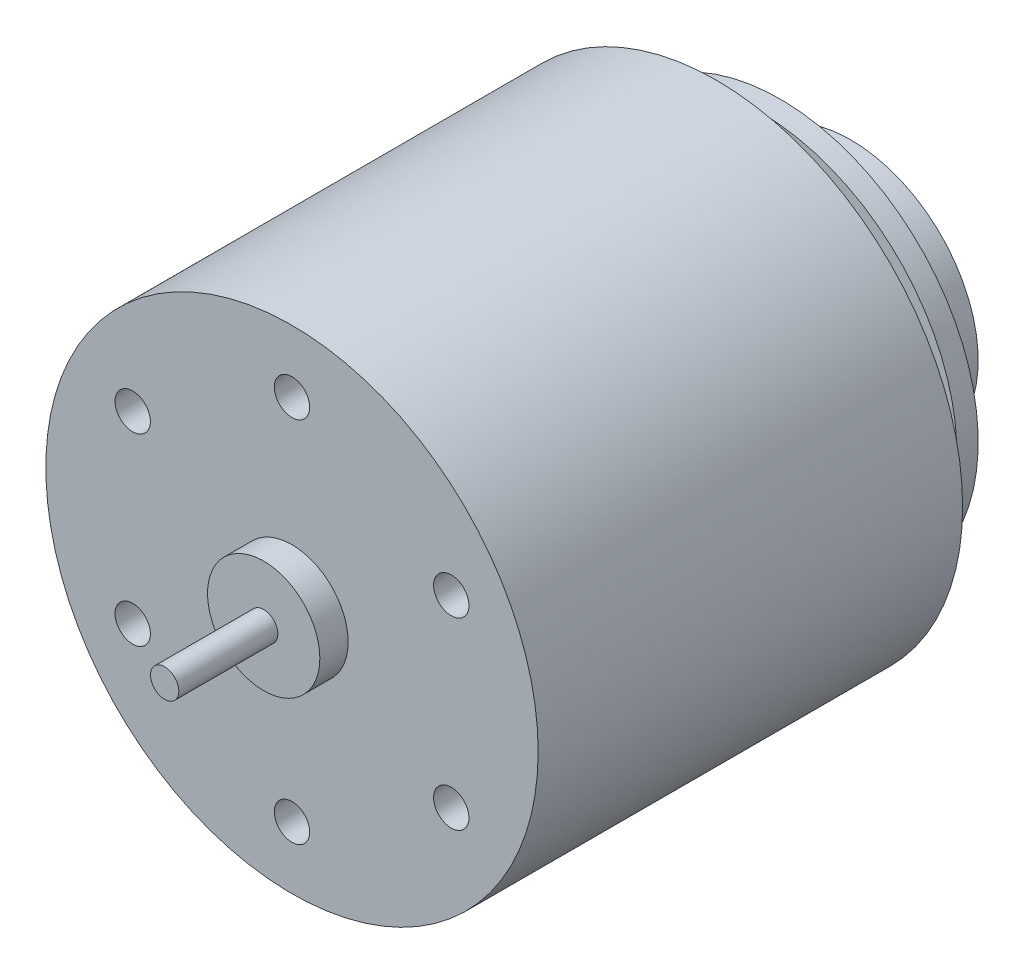
ISO-10303-21;
HEADER;
FILE_DESCRIPTION(('STEP AP214'),'2;1');
FILE_NAME('part.step','',(''),(''),'','','');
FILE_SCHEMA(('AUTOMOTIVE_DESIGN { 1 0 10303 214 1 1 1 1 }'));
ENDSEC;
DATA;
#1=APPLICATION_CONTEXT('core data for automotive mechanical design processes');
#2=APPLICATION_PROTOCOL_DEFINITION('international standard','automotive_design',2000,#1);
#3=PRODUCT_CONTEXT('',#1,'mechanical');
#4=PRODUCT('Part','Part','',(#3));
#5=PRODUCT_RELATED_PRODUCT_CATEGORY('part','',(#4));
#6=PRODUCT_DEFINITION_FORMATION('','',#4);
#7=PRODUCT_DEFINITION_CONTEXT('part definition',#1,'design');
#8=PRODUCT_DEFINITION('design','',#6,#7);
#9=PRODUCT_DEFINITION_SHAPE('','',#8);
#10=(LENGTH_UNIT() NAMED_UNIT(*) SI_UNIT(.MILLI.,.METRE.));
#11=(NAMED_UNIT(*) PLANE_ANGLE_UNIT() SI_UNIT($,.RADIAN.));
#12=(NAMED_UNIT(*) SI_UNIT($,.STERADIAN.) SOLID_ANGLE_UNIT());
#13=UNCERTAINTY_MEASURE_WITH_UNIT(LENGTH_MEASURE(1.E-05),#10,'distance_accuracy_value','');
#14=(GEOMETRIC_REPRESENTATION_CONTEXT(3) GLOBAL_UNCERTAINTY_ASSIGNED_CONTEXT((#13)) GLOBAL_UNIT_ASSIGNED_CONTEXT((#10,
#11,#12)) REPRESENTATION_CONTEXT('',''));
#15=CARTESIAN_POINT('',(0.,0.,0.));
#16=DIRECTION('',(0.,0.,1.));
#17=DIRECTION('',(1.,0.,0.));
#18=AXIS2_PLACEMENT_3D('',#15,#16,#17);
#19=CARTESIAN_POINT('',(0.,0.,-39.5));
#20=DIRECTION('',(0.,0.,1.));
#21=DIRECTION('',(1.,0.,0.));
#22=AXIS2_PLACEMENT_3D('',#19,#20,#21);
#23=CYLINDRICAL_SURFACE('',#22,9.);
#24=CARTESIAN_POINT('',(0.,0.,-39.5));
#25=DIRECTION('',(0.,0.,-1.));
#26=DIRECTION('',(-1.,0.,0.));
#27=AXIS2_PLACEMENT_3D('',#24,#25,#26);
#28=CIRCLE('',#27,9.);
#29=CARTESIAN_POINT('',(-9.,0.,-39.5));
#30=VERTEX_POINT('',#29);
#31=EDGE_CURVE('E11',#30,#30,#28,.T.);
#32=ORIENTED_EDGE('',*,*,#31,.F.);
#33=EDGE_LOOP('',(#32));
#34=FACE_BOUND('',#33,.T.);
#35=CARTESIAN_POINT('',(0.,0.,-36.5));
#36=DIRECTION('',(0.,0.,-1.));
#37=DIRECTION('',(-1.,0.,0.));
#38=AXIS2_PLACEMENT_3D('',#35,#36,#37);
#39=CIRCLE('',#38,9.);
#40=CARTESIAN_POINT('',(-9.,0.,-36.5));
#41=VERTEX_POINT('',#40);
#42=EDGE_CURVE('E51',#41,#41,#39,.T.);
#43=ORIENTED_EDGE('',*,*,#42,.T.);
#44=EDGE_LOOP('',(#43));
#45=FACE_BOUND('',#44,.T.);
#46=ADVANCED_FACE('F48',(#34,#45),#23,.T.);
#47=CARTESIAN_POINT('',(0.,0.,-39.5));
#48=DIRECTION('',(0.,0.,-1.));
#49=DIRECTION('',(-1.,0.,0.));
#50=AXIS2_PLACEMENT_3D('',#47,#48,#49);
#51=PLANE('',#50);
#52=ORIENTED_EDGE('',*,*,#31,.T.);
#53=EDGE_LOOP('',(#52));
#54=FACE_BOUND('',#53,.T.);
#55=ADVANCED_FACE('F63',(#54),#51,.T.);
#56=CARTESIAN_POINT('',(0.,0.,-36.5));
#57=DIRECTION('',(0.,0.,-1.));
#58=DIRECTION('',(-1.,0.,0.));
#59=AXIS2_PLACEMENT_3D('',#56,#57,#58);
#60=PLANE('',#59);
#61=ORIENTED_EDGE('',*,*,#42,.F.);
#62=EDGE_LOOP('',(#61));
#63=FACE_BOUND('',#62,.T.);
#64=ADVANCED_FACE('F61',(#63),#60,.F.);
#65=CLOSED_SHELL('',(#46,#55,#64));
#66=MANIFOLD_SOLID_BREP('B2',#65);
#67=CARTESIAN_POINT('',(0.,0.,-34.5));
#68=DIRECTION('',(0.,0.,1.));
#69=DIRECTION('',(1.,0.,0.));
#70=AXIS2_PLACEMENT_3D('',#67,#68,#69);
#71=CYLINDRICAL_SURFACE('',#70,14.);
#72=CARTESIAN_POINT('',(0.,0.,-34.5));
#73=DIRECTION('',(0.,0.,-1.));
#74=DIRECTION('',(-1.,0.,0.));
#75=AXIS2_PLACEMENT_3D('',#72,#73,#74);
#76=CIRCLE('',#75,14.);
#77=CARTESIAN_POINT('',(-14.,0.,-34.5));
#78=VERTEX_POINT('',#77);
#79=EDGE_CURVE('E47',#78,#78,#76,.T.);
#80=ORIENTED_EDGE('',*,*,#79,.F.);
#81=EDGE_LOOP('',(#80));
#82=FACE_BOUND('',#81,.T.);
#83=CARTESIAN_POINT('',(0.,0.,-33.));
#84=DIRECTION('',(0.,0.,-1.));
#85=DIRECTION('',(-1.,0.,0.));
#86=AXIS2_PLACEMENT_3D('',#83,#84,#85);
#87=CIRCLE('',#86,14.);
#88=CARTESIAN_POINT('',(-14.,0.,-33.));
#89=VERTEX_POINT('',#88);
#90=EDGE_CURVE('E103',#89,#89,#87,.T.);
#91=ORIENTED_EDGE('',*,*,#90,.T.);
#92=EDGE_LOOP('',(#91));
#93=FACE_BOUND('',#92,.T.);
#94=ADVANCED_FACE('F100',(#82,#93),#71,.T.);
#95=CARTESIAN_POINT('',(0.,0.,-34.5));
#96=DIRECTION('',(0.,0.,-1.));
#97=DIRECTION('',(-1.,0.,0.));
#98=AXIS2_PLACEMENT_3D('',#95,#96,#97);
#99=PLANE('',#98);
#100=ORIENTED_EDGE('',*,*,#79,.T.);
#101=EDGE_LOOP('',(#100));
#102=FACE_BOUND('',#101,.T.);
#103=ADVANCED_FACE('F115',(#102),#99,.T.);
#104=CARTESIAN_POINT('',(0.,0.,-33.));
#105=DIRECTION('',(0.,0.,-1.));
#106=DIRECTION('',(-1.,0.,0.));
#107=AXIS2_PLACEMENT_3D('',#104,#105,#106);
#108=PLANE('',#107);
#109=ORIENTED_EDGE('',*,*,#90,.F.);
#110=EDGE_LOOP('',(#109));
#111=FACE_BOUND('',#110,.T.);
#112=ADVANCED_FACE('F113',(#111),#108,.F.);
#113=CLOSED_SHELL('',(#94,#103,#112));
#114=MANIFOLD_SOLID_BREP('B6',#113);
#115=CARTESIAN_POINT('',(0.,0.,-30.));
#116=DIRECTION('',(0.,0.,-1.));
#117=DIRECTION('',(-1.,0.,0.));
#118=AXIS2_PLACEMENT_3D('',#115,#116,#117);
#119=PLANE('',#118);
#120=CARTESIAN_POINT('',(0.,0.,-30.));
#121=DIRECTION('',(0.,0.,-1.));
#122=DIRECTION('',(-1.,0.,0.));
#123=AXIS2_PLACEMENT_3D('',#120,#121,#122);
#124=CIRCLE('',#123,4.);
#125=CARTESIAN_POINT('',(-4.,0.,-30.));
#126=VERTEX_POINT('',#125);
#127=EDGE_CURVE('E295',#126,#126,#124,.T.);
#128=ORIENTED_EDGE('',*,*,#127,.F.);
#129=EDGE_LOOP('',(#128));
#130=FACE_BOUND('',#129,.T.);
#131=CARTESIAN_POINT('',(0.,0.,-30.));
#132=DIRECTION('',(0.,0.,-1.));
#133=DIRECTION('',(-1.,0.,0.));
#134=AXIS2_PLACEMENT_3D('',#131,#132,#133);
#135=CIRCLE('',#134,17.4);
#136=CARTESIAN_POINT('',(-17.4,0.,-30.));
#137=VERTEX_POINT('',#136);
#138=EDGE_CURVE('E298',#137,#137,#135,.T.);
#139=ORIENTED_EDGE('',*,*,#138,.T.);
#140=EDGE_LOOP('',(#139));
#141=FACE_BOUND('',#140,.T.);
#142=DIRECTION('',(-1.,0.,0.));
#143=VECTOR('',#142,1.);
#144=CARTESIAN_POINT('',(1.75,11.55,-30.));
#145=LINE('',#144,#143);
#146=CARTESIAN_POINT('',(1.75,11.55,-30.));
#147=VERTEX_POINT('',#146);
#148=CARTESIAN_POINT('',(-1.75,11.55,-30.));
#149=VERTEX_POINT('',#148);
#150=EDGE_CURVE('E280',#147,#149,#145,.T.);
#151=ORIENTED_EDGE('',*,*,#150,.F.);
#152=DIRECTION('',(0.,-1.,0.));
#153=VECTOR('',#152,1.);
#154=CARTESIAN_POINT('',(1.75,12.55,-30.));
#155=LINE('',#154,#153);
#156=CARTESIAN_POINT('',(1.75,12.55,-30.));
#157=VERTEX_POINT('',#156);
#158=EDGE_CURVE('E243',#157,#147,#155,.T.);
#159=ORIENTED_EDGE('',*,*,#158,.F.);
#160=DIRECTION('',(1.,0.,0.));
#161=VECTOR('',#160,1.);
#162=CARTESIAN_POINT('',(1.75,12.55,-30.));
#163=LINE('',#162,#161);
#164=CARTESIAN_POINT('',(-1.75,12.55,-30.));
#165=VERTEX_POINT('',#164);
#166=EDGE_CURVE('E274',#165,#157,#163,.T.);
#167=ORIENTED_EDGE('',*,*,#166,.F.);
#168=DIRECTION('',(0.,1.,0.));
#169=VECTOR('',#168,1.);
#170=CARTESIAN_POINT('',(-1.75,12.55,-30.));
#171=LINE('',#170,#169);
#172=EDGE_CURVE('E283',#149,#165,#171,.T.);
#173=ORIENTED_EDGE('',*,*,#172,.F.);
#174=EDGE_LOOP('',(#151,#159,#167,#173));
#175=FACE_BOUND('',#174,.T.);
#176=DIRECTION('',(0.,1.,0.));
#177=VECTOR('',#176,1.);
#178=CARTESIAN_POINT('',(-1.75,-12.55,-30.));
#179=LINE('',#178,#177);
#180=CARTESIAN_POINT('',(-1.75,-12.55,-30.));
#181=VERTEX_POINT('',#180);
#182=CARTESIAN_POINT('',(-1.75,-11.55,-30.));
#183=VERTEX_POINT('',#182);
#184=EDGE_CURVE('E237',#181,#183,#179,.T.);
#185=ORIENTED_EDGE('',*,*,#184,.F.);
#186=DIRECTION('',(-1.,0.,0.));
#187=VECTOR('',#186,1.);
#188=CARTESIAN_POINT('',(1.75,-12.55,-30.));
#189=LINE('',#188,#187);
#190=CARTESIAN_POINT('',(1.75,-12.55,-30.));
#191=VERTEX_POINT('',#190);
#192=EDGE_CURVE('E247',#191,#181,#189,.T.);
#193=ORIENTED_EDGE('',*,*,#192,.F.);
#194=DIRECTION('',(0.,-1.,0.));
#195=VECTOR('',#194,1.);
#196=CARTESIAN_POINT('',(1.75,-12.55,-30.));
#197=LINE('',#196,#195);
#198=CARTESIAN_POINT('',(1.75,-11.55,-30.));
#199=VERTEX_POINT('',#198);
#200=EDGE_CURVE('E259',#199,#191,#197,.T.);
#201=ORIENTED_EDGE('',*,*,#200,.F.);
#202=DIRECTION('',(1.,0.,0.));
#203=VECTOR('',#202,1.);
#204=CARTESIAN_POINT('',(1.75,-11.55,-30.));
#205=LINE('',#204,#203);
#206=EDGE_CURVE('E257',#183,#199,#205,.T.);
#207=ORIENTED_EDGE('',*,*,#206,.F.);
#208=EDGE_LOOP('',(#185,#193,#201,#207));
#209=FACE_BOUND('',#208,.T.);
#210=ADVANCED_FACE('F143',(#130,#141,#175,#209),#119,.T.);
#211=CARTESIAN_POINT('',(0.,0.,-30.));
#212=DIRECTION('',(0.,0.,1.));
#213=DIRECTION('',(1.,0.,0.));
#214=AXIS2_PLACEMENT_3D('',#211,#212,#213);
#215=CYLINDRICAL_SURFACE('',#214,17.4);
#216=ORIENTED_EDGE('',*,*,#138,.F.);
#217=EDGE_LOOP('',(#216));
#218=FACE_BOUND('',#217,.T.);
#219=CARTESIAN_POINT('',(0.,0.,0.));
#220=DIRECTION('',(0.,0.,1.));
#221=DIRECTION('',(1.,0.,0.));
#222=AXIS2_PLACEMENT_3D('',#219,#220,#221);
#223=CIRCLE('',#222,17.4);
#224=CARTESIAN_POINT('',(17.4,0.,0.));
#225=VERTEX_POINT('',#224);
#226=EDGE_CURVE('E722',#225,#225,#223,.T.);
#227=ORIENTED_EDGE('',*,*,#226,.F.);
#228=EDGE_LOOP('',(#227));
#229=FACE_BOUND('',#228,.T.);
#230=ADVANCED_FACE('F371',(#218,#229),#215,.T.);
#231=CARTESIAN_POINT('',(0.,0.,-31.));
#232=DIRECTION('',(0.,0.,1.));
#233=DIRECTION('',(1.,0.,0.));
#234=AXIS2_PLACEMENT_3D('',#231,#232,#233);
#235=CYLINDRICAL_SURFACE('',#234,4.);
#236=CARTESIAN_POINT('',(0.,0.,-30.5));
#237=DIRECTION('',(0.,0.,-1.));
#238=DIRECTION('',(-1.,0.,0.));
#239=AXIS2_PLACEMENT_3D('',#236,#237,#238);
#240=CIRCLE('',#239,4.);
#241=CARTESIAN_POINT('',(-4.,0.,-30.5));
#242=VERTEX_POINT('',#241);
#243=EDGE_CURVE('E304',#242,#242,#240,.F.);
#244=ORIENTED_EDGE('',*,*,#243,.T.);
#245=EDGE_LOOP('',(#244));
#246=FACE_BOUND('',#245,.T.);
#247=ORIENTED_EDGE('',*,*,#127,.T.);
#248=EDGE_LOOP('',(#247));
#249=FACE_BOUND('',#248,.T.);
#250=ADVANCED_FACE('F377',(#246,#249),#235,.T.);
#251=CARTESIAN_POINT('',(0.,0.,-31.));
#252=DIRECTION('',(0.,0.,-1.));
#253=DIRECTION('',(-1.,0.,0.));
#254=AXIS2_PLACEMENT_3D('',#251,#252,#253);
#255=PLANE('',#254);
#256=CARTESIAN_POINT('',(0.,0.,-31.));
#257=DIRECTION('',(0.,0.,-1.));
#258=DIRECTION('',(-1.,0.,0.));
#259=AXIS2_PLACEMENT_3D('',#256,#257,#258);
#260=CIRCLE('',#259,1.5);
#261=CARTESIAN_POINT('',(-1.5,0.,-31.));
#262=VERTEX_POINT('',#261);
#263=EDGE_CURVE('E727',#262,#262,#260,.T.);
#264=ORIENTED_EDGE('',*,*,#263,.F.);
#265=EDGE_LOOP('',(#264));
#266=FACE_BOUND('',#265,.T.);
#267=CARTESIAN_POINT('',(0.,0.,-31.));
#268=DIRECTION('',(0.,0.,-1.));
#269=DIRECTION('',(-1.,0.,0.));
#270=AXIS2_PLACEMENT_3D('',#267,#268,#269);
#271=CIRCLE('',#270,3.5);
#272=CARTESIAN_POINT('',(-3.5,0.,-31.));
#273=VERTEX_POINT('',#272);
#274=EDGE_CURVE('E301',#273,#273,#271,.T.);
#275=ORIENTED_EDGE('',*,*,#274,.T.);
#276=EDGE_LOOP('',(#275));
#277=FACE_BOUND('',#276,.T.);
#278=ADVANCED_FACE('F366',(#266,#277),#255,.T.);
#279=CARTESIAN_POINT('',(0.,0.,-30.5));
#280=DIRECTION('',(0.,0.,-1.));
#281=DIRECTION('',(-1.,0.,0.));
#282=AXIS2_PLACEMENT_3D('',#279,#280,#281);
#283=TOROIDAL_SURFACE('',#282,3.5,0.5);
#284=ORIENTED_EDGE('',*,*,#243,.F.);
#285=EDGE_LOOP('',(#284));
#286=FACE_BOUND('',#285,.T.);
#287=ORIENTED_EDGE('',*,*,#274,.F.);
#288=EDGE_LOOP('',(#287));
#289=FACE_BOUND('',#288,.T.);
#290=ADVANCED_FACE('F359',(#286,#289),#283,.T.);
#291=CARTESIAN_POINT('',(1.75,12.55,-35.6));
#292=DIRECTION('',(-1.,0.,0.));
#293=DIRECTION('',(0.,-1.,0.));
#294=AXIS2_PLACEMENT_3D('',#291,#292,#293);
#295=PLANE('',#294);
#296=DIRECTION('',(0.,0.,1.));
#297=VECTOR('',#296,1.);
#298=CARTESIAN_POINT('',(1.75,11.55,-35.6));
#299=LINE('',#298,#297);
#300=CARTESIAN_POINT('',(1.75,11.55,-35.1));
#301=VERTEX_POINT('',#300);
#302=EDGE_CURVE('E293',#301,#147,#299,.T.);
#303=ORIENTED_EDGE('',*,*,#302,.F.);
#304=DIRECTION('',(0.,-1.,0.));
#305=VECTOR('',#304,1.);
#306=CARTESIAN_POINT('',(1.75,12.55,-35.1));
#307=LINE('',#306,#305);
#308=CARTESIAN_POINT('',(1.75,12.55,-35.1));
#309=VERTEX_POINT('',#308);
#310=EDGE_CURVE('E98',#301,#309,#307,.F.);
#311=ORIENTED_EDGE('',*,*,#310,.T.);
#312=DIRECTION('',(0.,0.,1.));
#313=VECTOR('',#312,1.);
#314=CARTESIAN_POINT('',(1.75,12.55,-35.6));
#315=LINE('',#314,#313);
#316=EDGE_CURVE('E277',#309,#157,#315,.T.);
#317=ORIENTED_EDGE('',*,*,#316,.T.);
#318=ORIENTED_EDGE('',*,*,#158,.T.);
#319=EDGE_LOOP('',(#303,#311,#317,#318));
#320=FACE_BOUND('',#319,.T.);
#321=ADVANCED_FACE('F357',(#320),#295,.F.);
#322=CARTESIAN_POINT('',(1.75,11.55,-35.6));
#323=DIRECTION('',(0.,1.,0.));
#324=DIRECTION('',(0.,0.,1.));
#325=AXIS2_PLACEMENT_3D('',#322,#323,#324);
#326=PLANE('',#325);
#327=DIRECTION('',(0.,0.,1.));
#328=VECTOR('',#327,1.);
#329=CARTESIAN_POINT('',(-1.75,11.55,-35.6));
#330=LINE('',#329,#328);
#331=CARTESIAN_POINT('',(-1.75,11.55,-35.1));
#332=VERTEX_POINT('',#331);
#333=EDGE_CURVE('E291',#332,#149,#330,.T.);
#334=ORIENTED_EDGE('',*,*,#333,.F.);
#335=CARTESIAN_POINT('',(-1.25,11.55,-35.1));
#336=DIRECTION('',(0.,1.,0.));
#337=DIRECTION('',(0.,0.,1.));
#338=AXIS2_PLACEMENT_3D('',#335,#336,#337);
#339=CIRCLE('',#338,0.5);
#340=CARTESIAN_POINT('',(-1.25,11.55,-35.6));
#341=VERTEX_POINT('',#340);
#342=EDGE_CURVE('E151',#332,#341,#339,.F.);
#343=ORIENTED_EDGE('',*,*,#342,.T.);
#344=DIRECTION('',(-1.,0.,0.));
#345=VECTOR('',#344,1.);
#346=CARTESIAN_POINT('',(1.75,11.55,-35.6));
#347=LINE('',#346,#345);
#348=CARTESIAN_POINT('',(1.25,11.55,-35.6));
#349=VERTEX_POINT('',#348);
#350=EDGE_CURVE('E270',#349,#341,#347,.T.);
#351=ORIENTED_EDGE('',*,*,#350,.F.);
#352=CARTESIAN_POINT('',(1.25,11.55,-35.1));
#353=DIRECTION('',(0.,1.,0.));
#354=DIRECTION('',(0.,0.,1.));
#355=AXIS2_PLACEMENT_3D('',#352,#353,#354);
#356=CIRCLE('',#355,0.5);
#357=EDGE_CURVE('E158',#349,#301,#356,.F.);
#358=ORIENTED_EDGE('',*,*,#357,.T.);
#359=ORIENTED_EDGE('',*,*,#302,.T.);
#360=ORIENTED_EDGE('',*,*,#150,.T.);
#361=EDGE_LOOP('',(#334,#343,#351,#358,#359,#360));
#362=FACE_BOUND('',#361,.T.);
#363=ADVANCED_FACE('F336',(#362),#326,.F.);
#364=CARTESIAN_POINT('',(-1.75,12.55,-35.6));
#365=DIRECTION('',(1.,0.,0.));
#366=DIRECTION('',(0.,1.,0.));
#367=AXIS2_PLACEMENT_3D('',#364,#365,#366);
#368=PLANE('',#367);
#369=DIRECTION('',(0.,0.,1.));
#370=VECTOR('',#369,1.);
#371=CARTESIAN_POINT('',(-1.75,12.55,-35.6));
#372=LINE('',#371,#370);
#373=CARTESIAN_POINT('',(-1.75,12.55,-35.1));
#374=VERTEX_POINT('',#373);
#375=EDGE_CURVE('E289',#374,#165,#372,.T.);
#376=ORIENTED_EDGE('',*,*,#375,.F.);
#377=DIRECTION('',(0.,1.,0.));
#378=VECTOR('',#377,1.);
#379=CARTESIAN_POINT('',(-1.75,11.55,-35.1));
#380=LINE('',#379,#378);
#381=EDGE_CURVE('E166',#374,#332,#380,.F.);
#382=ORIENTED_EDGE('',*,*,#381,.T.);
#383=ORIENTED_EDGE('',*,*,#333,.T.);
#384=ORIENTED_EDGE('',*,*,#172,.T.);
#385=EDGE_LOOP('',(#376,#382,#383,#384));
#386=FACE_BOUND('',#385,.T.);
#387=ADVANCED_FACE('F346',(#386),#368,.F.);
#388=CARTESIAN_POINT('',(1.75,12.55,-35.6));
#389=DIRECTION('',(0.,-1.,0.));
#390=DIRECTION('',(0.,0.,-1.));
#391=AXIS2_PLACEMENT_3D('',#388,#389,#390);
#392=PLANE('',#391);
#393=DIRECTION('',(1.,0.,0.));
#394=VECTOR('',#393,1.);
#395=CARTESIAN_POINT('',(1.75,12.55,-35.6));
#396=LINE('',#395,#394);
#397=CARTESIAN_POINT('',(-1.25,12.55,-35.6));
#398=VERTEX_POINT('',#397);
#399=CARTESIAN_POINT('',(1.25,12.55,-35.6));
#400=VERTEX_POINT('',#399);
#401=EDGE_CURVE('E273',#398,#400,#396,.T.);
#402=ORIENTED_EDGE('',*,*,#401,.F.);
#403=CARTESIAN_POINT('',(-1.25,12.55,-35.1));
#404=DIRECTION('',(0.,-1.,0.));
#405=DIRECTION('',(0.,0.,-1.));
#406=AXIS2_PLACEMENT_3D('',#403,#404,#405);
#407=CIRCLE('',#406,0.5);
#408=EDGE_CURVE('E332',#398,#374,#407,.F.);
#409=ORIENTED_EDGE('',*,*,#408,.T.);
#410=ORIENTED_EDGE('',*,*,#375,.T.);
#411=ORIENTED_EDGE('',*,*,#166,.T.);
#412=ORIENTED_EDGE('',*,*,#316,.F.);
#413=CARTESIAN_POINT('',(1.25,12.55,-35.1));
#414=DIRECTION('',(0.,-1.,0.));
#415=DIRECTION('',(0.,0.,-1.));
#416=AXIS2_PLACEMENT_3D('',#413,#414,#415);
#417=CIRCLE('',#416,0.5);
#418=EDGE_CURVE('E330',#309,#400,#417,.F.);
#419=ORIENTED_EDGE('',*,*,#418,.T.);
#420=EDGE_LOOP('',(#402,#409,#410,#411,#412,#419));
#421=FACE_BOUND('',#420,.T.);
#422=ADVANCED_FACE('F345',(#421),#392,.F.);
#423=CARTESIAN_POINT('',(1.75,11.55,-35.6));
#424=DIRECTION('',(0.,0.,-1.));
#425=DIRECTION('',(-1.,0.,0.));
#426=AXIS2_PLACEMENT_3D('',#423,#424,#425);
#427=PLANE('',#426);
#428=ORIENTED_EDGE('',*,*,#350,.T.);
#429=DIRECTION('',(0.,1.,0.));
#430=VECTOR('',#429,1.);
#431=CARTESIAN_POINT('',(-1.25,12.55,-35.6));
#432=LINE('',#431,#430);
#433=EDGE_CURVE('E327',#341,#398,#432,.T.);
#434=ORIENTED_EDGE('',*,*,#433,.T.);
#435=ORIENTED_EDGE('',*,*,#401,.T.);
#436=DIRECTION('',(0.,-1.,0.));
#437=VECTOR('',#436,1.);
#438=CARTESIAN_POINT('',(1.25,11.55,-35.6));
#439=LINE('',#438,#437);
#440=EDGE_CURVE('E324',#400,#349,#439,.T.);
#441=ORIENTED_EDGE('',*,*,#440,.T.);
#442=EDGE_LOOP('',(#428,#434,#435,#441));
#443=FACE_BOUND('',#442,.T.);
#444=ADVANCED_FACE('F340',(#443),#427,.T.);
#445=CARTESIAN_POINT('',(1.75,-12.55,-35.6));
#446=DIRECTION('',(0.,1.,0.));
#447=DIRECTION('',(0.,0.,1.));
#448=AXIS2_PLACEMENT_3D('',#445,#446,#447);
#449=PLANE('',#448);
#450=DIRECTION('',(0.,0.,1.));
#451=VECTOR('',#450,1.);
#452=CARTESIAN_POINT('',(-1.75,-12.55,-35.6));
#453=LINE('',#452,#451);
#454=CARTESIAN_POINT('',(-1.75,-12.55,-35.1));
#455=VERTEX_POINT('',#454);
#456=EDGE_CURVE('E232',#455,#181,#453,.T.);
#457=ORIENTED_EDGE('',*,*,#456,.F.);
#458=CARTESIAN_POINT('',(-1.25,-12.55,-35.1));
#459=DIRECTION('',(0.,1.,0.));
#460=DIRECTION('',(0.,0.,1.));
#461=AXIS2_PLACEMENT_3D('',#458,#459,#460);
#462=CIRCLE('',#461,0.5);
#463=CARTESIAN_POINT('',(-1.25,-12.55,-35.6));
#464=VERTEX_POINT('',#463);
#465=EDGE_CURVE('E320',#455,#464,#462,.F.);
#466=ORIENTED_EDGE('',*,*,#465,.T.);
#467=DIRECTION('',(-1.,0.,0.));
#468=VECTOR('',#467,1.);
#469=CARTESIAN_POINT('',(1.75,-12.55,-35.6));
#470=LINE('',#469,#468);
#471=CARTESIAN_POINT('',(1.25,-12.55,-35.6));
#472=VERTEX_POINT('',#471);
#473=EDGE_CURVE('E264',#472,#464,#470,.T.);
#474=ORIENTED_EDGE('',*,*,#473,.F.);
#475=CARTESIAN_POINT('',(1.25,-12.55,-35.1));
#476=DIRECTION('',(0.,1.,0.));
#477=DIRECTION('',(0.,0.,1.));
#478=AXIS2_PLACEMENT_3D('',#475,#476,#477);
#479=CIRCLE('',#478,0.5);
#480=CARTESIAN_POINT('',(1.75,-12.55,-35.1));
#481=VERTEX_POINT('',#480);
#482=EDGE_CURVE('E318',#472,#481,#479,.F.);
#483=ORIENTED_EDGE('',*,*,#482,.T.);
#484=DIRECTION('',(0.,0.,1.));
#485=VECTOR('',#484,1.);
#486=CARTESIAN_POINT('',(1.75,-12.55,-35.6));
#487=LINE('',#486,#485);
#488=EDGE_CURVE('E250',#481,#191,#487,.T.);
#489=ORIENTED_EDGE('',*,*,#488,.T.);
#490=ORIENTED_EDGE('',*,*,#192,.T.);
#491=EDGE_LOOP('',(#457,#466,#474,#483,#489,#490));
#492=FACE_BOUND('',#491,.T.);
#493=ADVANCED_FACE('F248',(#492),#449,.F.);
#494=CARTESIAN_POINT('',(-1.75,-12.55,-35.6));
#495=DIRECTION('',(1.,0.,0.));
#496=DIRECTION('',(0.,1.,0.));
#497=AXIS2_PLACEMENT_3D('',#494,#495,#496);
#498=PLANE('',#497);
#499=DIRECTION('',(0.,0.,1.));
#500=VECTOR('',#499,1.);
#501=CARTESIAN_POINT('',(-1.75,-11.55,-35.6));
#502=LINE('',#501,#500);
#503=CARTESIAN_POINT('',(-1.75,-11.55,-35.1));
#504=VERTEX_POINT('',#503);
#505=EDGE_CURVE('E244',#504,#183,#502,.T.);
#506=ORIENTED_EDGE('',*,*,#505,.F.);
#507=DIRECTION('',(0.,1.,0.));
#508=VECTOR('',#507,1.);
#509=CARTESIAN_POINT('',(-1.75,-12.55,-35.1));
#510=LINE('',#509,#508);
#511=EDGE_CURVE('E240',#504,#455,#510,.F.);
#512=ORIENTED_EDGE('',*,*,#511,.T.);
#513=ORIENTED_EDGE('',*,*,#456,.T.);
#514=ORIENTED_EDGE('',*,*,#184,.T.);
#515=EDGE_LOOP('',(#506,#512,#513,#514));
#516=FACE_BOUND('',#515,.T.);
#517=ADVANCED_FACE('F235',(#516),#498,.F.);
#518=CARTESIAN_POINT('',(1.75,-11.55,-35.6));
#519=DIRECTION('',(0.,-1.,0.));
#520=DIRECTION('',(0.,0.,-1.));
#521=AXIS2_PLACEMENT_3D('',#518,#519,#520);
#522=PLANE('',#521);
#523=DIRECTION('',(1.,0.,0.));
#524=VECTOR('',#523,1.);
#525=CARTESIAN_POINT('',(1.75,-11.55,-35.6));
#526=LINE('',#525,#524);
#527=CARTESIAN_POINT('',(-1.25,-11.55,-35.6));
#528=VERTEX_POINT('',#527);
#529=CARTESIAN_POINT('',(1.25,-11.55,-35.6));
#530=VERTEX_POINT('',#529);
#531=EDGE_CURVE('E267',#528,#530,#526,.T.);
#532=ORIENTED_EDGE('',*,*,#531,.F.);
#533=CARTESIAN_POINT('',(-1.25,-11.55,-35.1));
#534=DIRECTION('',(0.,-1.,0.));
#535=DIRECTION('',(0.,0.,-1.));
#536=AXIS2_PLACEMENT_3D('',#533,#534,#535);
#537=CIRCLE('',#536,0.5);
#538=EDGE_CURVE('E315',#528,#504,#537,.F.);
#539=ORIENTED_EDGE('',*,*,#538,.T.);
#540=ORIENTED_EDGE('',*,*,#505,.T.);
#541=ORIENTED_EDGE('',*,*,#206,.T.);
#542=DIRECTION('',(0.,0.,1.));
#543=VECTOR('',#542,1.);
#544=CARTESIAN_POINT('',(1.75,-11.55,-35.6));
#545=LINE('',#544,#543);
#546=CARTESIAN_POINT('',(1.75,-11.55,-35.1));
#547=VERTEX_POINT('',#546);
#548=EDGE_CURVE('E266',#547,#199,#545,.T.);
#549=ORIENTED_EDGE('',*,*,#548,.F.);
#550=CARTESIAN_POINT('',(1.25,-11.55,-35.1));
#551=DIRECTION('',(0.,-1.,0.));
#552=DIRECTION('',(0.,0.,-1.));
#553=AXIS2_PLACEMENT_3D('',#550,#551,#552);
#554=CIRCLE('',#553,0.5);
#555=EDGE_CURVE('E313',#547,#530,#554,.F.);
#556=ORIENTED_EDGE('',*,*,#555,.T.);
#557=EDGE_LOOP('',(#532,#539,#540,#541,#549,#556));
#558=FACE_BOUND('',#557,.T.);
#559=ADVANCED_FACE('F419',(#558),#522,.F.);
#560=CARTESIAN_POINT('',(1.75,-12.55,-35.6));
#561=DIRECTION('',(-1.,0.,0.));
#562=DIRECTION('',(0.,-1.,0.));
#563=AXIS2_PLACEMENT_3D('',#560,#561,#562);
#564=PLANE('',#563);
#565=ORIENTED_EDGE('',*,*,#488,.F.);
#566=DIRECTION('',(0.,-1.,0.));
#567=VECTOR('',#566,1.);
#568=CARTESIAN_POINT('',(1.75,-11.55,-35.1));
#569=LINE('',#568,#567);
#570=EDGE_CURVE('E322',#481,#547,#569,.F.);
#571=ORIENTED_EDGE('',*,*,#570,.T.);
#572=ORIENTED_EDGE('',*,*,#548,.T.);
#573=ORIENTED_EDGE('',*,*,#200,.T.);
#574=EDGE_LOOP('',(#565,#571,#572,#573));
#575=FACE_BOUND('',#574,.T.);
#576=ADVANCED_FACE('F415',(#575),#564,.F.);
#577=CARTESIAN_POINT('',(-1.75,-12.55,-35.6));
#578=DIRECTION('',(0.,0.,-1.));
#579=DIRECTION('',(-1.,0.,0.));
#580=AXIS2_PLACEMENT_3D('',#577,#578,#579);
#581=PLANE('',#580);
#582=ORIENTED_EDGE('',*,*,#473,.T.);
#583=DIRECTION('',(0.,1.,0.));
#584=VECTOR('',#583,1.);
#585=CARTESIAN_POINT('',(-1.25,-11.55,-35.6));
#586=LINE('',#585,#584);
#587=EDGE_CURVE('E310',#464,#528,#586,.T.);
#588=ORIENTED_EDGE('',*,*,#587,.T.);
#589=ORIENTED_EDGE('',*,*,#531,.T.);
#590=DIRECTION('',(0.,-1.,0.));
#591=VECTOR('',#590,1.);
#592=CARTESIAN_POINT('',(1.25,-12.55,-35.6));
#593=LINE('',#592,#591);
#594=EDGE_CURVE('E307',#530,#472,#593,.T.);
#595=ORIENTED_EDGE('',*,*,#594,.T.);
#596=EDGE_LOOP('',(#582,#588,#589,#595));
#597=FACE_BOUND('',#596,.T.);
#598=ADVANCED_FACE('F388',(#597),#581,.T.);
#599=CARTESIAN_POINT('',(-1.25,-12.55,-35.1));
#600=DIRECTION('',(0.,-1.,0.));
#601=DIRECTION('',(1.,0.,0.));
#602=AXIS2_PLACEMENT_3D('',#599,#600,#601);
#603=CYLINDRICAL_SURFACE('',#602,0.5);
#604=ORIENTED_EDGE('',*,*,#465,.F.);
#605=ORIENTED_EDGE('',*,*,#511,.F.);
#606=ORIENTED_EDGE('',*,*,#538,.F.);
#607=ORIENTED_EDGE('',*,*,#587,.F.);
#608=EDGE_LOOP('',(#604,#605,#606,#607));
#609=FACE_BOUND('',#608,.T.);
#610=ADVANCED_FACE('F384',(#609),#603,.T.);
#611=CARTESIAN_POINT('',(1.25,-12.55,-35.1));
#612=DIRECTION('',(0.,1.,0.));
#613=DIRECTION('',(-1.,0.,0.));
#614=AXIS2_PLACEMENT_3D('',#611,#612,#613);
#615=CYLINDRICAL_SURFACE('',#614,0.5);
#616=ORIENTED_EDGE('',*,*,#555,.F.);
#617=ORIENTED_EDGE('',*,*,#570,.F.);
#618=ORIENTED_EDGE('',*,*,#482,.F.);
#619=ORIENTED_EDGE('',*,*,#594,.F.);
#620=EDGE_LOOP('',(#616,#617,#618,#619));
#621=FACE_BOUND('',#620,.T.);
#622=ADVANCED_FACE('F387',(#621),#615,.T.);
#623=CARTESIAN_POINT('',(-1.25,11.55,-35.1));
#624=DIRECTION('',(0.,-1.,0.));
#625=DIRECTION('',(1.,0.,0.));
#626=AXIS2_PLACEMENT_3D('',#623,#624,#625);
#627=CYLINDRICAL_SURFACE('',#626,0.5);
#628=ORIENTED_EDGE('',*,*,#342,.F.);
#629=ORIENTED_EDGE('',*,*,#381,.F.);
#630=ORIENTED_EDGE('',*,*,#408,.F.);
#631=ORIENTED_EDGE('',*,*,#433,.F.);
#632=EDGE_LOOP('',(#628,#629,#630,#631));
#633=FACE_BOUND('',#632,.T.);
#634=ADVANCED_FACE('F343',(#633),#627,.T.);
#635=CARTESIAN_POINT('',(1.25,11.55,-35.1));
#636=DIRECTION('',(0.,1.,0.));
#637=DIRECTION('',(-1.,0.,0.));
#638=AXIS2_PLACEMENT_3D('',#635,#636,#637);
#639=CYLINDRICAL_SURFACE('',#638,0.5);
#640=ORIENTED_EDGE('',*,*,#418,.F.);
#641=ORIENTED_EDGE('',*,*,#310,.F.);
#642=ORIENTED_EDGE('',*,*,#357,.F.);
#643=ORIENTED_EDGE('',*,*,#440,.F.);
#644=EDGE_LOOP('',(#640,#641,#642,#643));
#645=FACE_BOUND('',#644,.T.);
#646=ADVANCED_FACE('F145',(#645),#639,.T.);
#647=CARTESIAN_POINT('',(0.,0.,-39.55));
#648=DIRECTION('',(0.,0.,1.));
#649=DIRECTION('',(1.,0.,0.));
#650=AXIS2_PLACEMENT_3D('',#647,#648,#649);
#651=CYLINDRICAL_SURFACE('',#650,1.5);
#652=CARTESIAN_POINT('',(0.,0.,-39.55));
#653=DIRECTION('',(0.,0.,-1.));
#654=DIRECTION('',(-1.,0.,0.));
#655=AXIS2_PLACEMENT_3D('',#652,#653,#654);
#656=CIRCLE('',#655,1.5);
#657=CARTESIAN_POINT('',(-1.5,0.,-39.55));
#658=VERTEX_POINT('',#657);
#659=EDGE_CURVE('E254',#658,#658,#656,.T.);
#660=ORIENTED_EDGE('',*,*,#659,.F.);
#661=EDGE_LOOP('',(#660));
#662=FACE_BOUND('',#661,.T.);
#663=ORIENTED_EDGE('',*,*,#263,.T.);
#664=EDGE_LOOP('',(#663));
#665=FACE_BOUND('',#664,.T.);
#666=ADVANCED_FACE('F396',(#662,#665),#651,.T.);
#667=CARTESIAN_POINT('',(0.,0.,-39.55));
#668=DIRECTION('',(0.,0.,-1.));
#669=DIRECTION('',(-1.,0.,0.));
#670=AXIS2_PLACEMENT_3D('',#667,#668,#669);
#671=PLANE('',#670);
#672=ORIENTED_EDGE('',*,*,#659,.T.);
#673=EDGE_LOOP('',(#672));
#674=FACE_BOUND('',#673,.T.);
#675=ADVANCED_FACE('F400',(#674),#671,.T.);
#676=CARTESIAN_POINT('',(0.,0.,0.));
#677=DIRECTION('',(0.,0.,1.));
#678=DIRECTION('',(1.,0.,0.));
#679=AXIS2_PLACEMENT_3D('',#676,#677,#678);
#680=PLANE('',#679);
#681=CARTESIAN_POINT('',(11.2583302491976,6.50000000000013,0.));
#682=DIRECTION('',(0.,0.,1.));
#683=DIRECTION('',(0.50000000000001,-0.866025403784433,0.));
#684=AXIS2_PLACEMENT_3D('',#681,#682,#683);
#685=CIRCLE('',#684,1.25);
#686=CARTESIAN_POINT('',(11.8833302491976,5.41746824526959,0.));
#687=VERTEX_POINT('',#686);
#688=EDGE_CURVE('E678',#687,#687,#685,.T.);
#689=ORIENTED_EDGE('',*,*,#688,.F.);
#690=EDGE_LOOP('',(#689));
#691=FACE_BOUND('',#690,.T.);
#692=CARTESIAN_POINT('',(11.2583302491978,-6.4999999999999,0.));
#693=DIRECTION('',(0.,0.,1.));
#694=DIRECTION('',(-0.499999999999992,-0.866025403784443,0.));
#695=AXIS2_PLACEMENT_3D('',#692,#693,#694);
#696=CIRCLE('',#695,1.25);
#697=CARTESIAN_POINT('',(10.6333302491978,-7.58253175473045,0.));
#698=VERTEX_POINT('',#697);
#699=EDGE_CURVE('E677',#698,#698,#696,.T.);
#700=ORIENTED_EDGE('',*,*,#699,.F.);
#701=EDGE_LOOP('',(#700));
#702=FACE_BOUND('',#701,.T.);
#703=CARTESIAN_POINT('',(0.,-13.,0.));
#704=DIRECTION('',(0.,0.,1.));
#705=DIRECTION('',(-1.,0.,0.));
#706=AXIS2_PLACEMENT_3D('',#703,#704,#705);
#707=CIRCLE('',#706,1.25);
#708=CARTESIAN_POINT('',(-1.25,-13.,0.));
#709=VERTEX_POINT('',#708);
#710=EDGE_CURVE('E687',#709,#709,#707,.T.);
#711=ORIENTED_EDGE('',*,*,#710,.F.);
#712=EDGE_LOOP('',(#711));
#713=FACE_BOUND('',#712,.T.);
#714=CARTESIAN_POINT('',(-11.2583302491977,-6.50000000000005,0.));
#715=DIRECTION('',(0.,0.,1.));
#716=DIRECTION('',(-0.500000000000004,0.866025403784436,0.));
#717=AXIS2_PLACEMENT_3D('',#714,#715,#716);
#718=CIRCLE('',#717,1.25);
#719=CARTESIAN_POINT('',(-11.8833302491977,-5.41746824526951,0.));
#720=VERTEX_POINT('',#719);
#721=EDGE_CURVE('E692',#720,#720,#718,.T.);
#722=ORIENTED_EDGE('',*,*,#721,.F.);
#723=EDGE_LOOP('',(#722));
#724=FACE_BOUND('',#723,.T.);
#725=CARTESIAN_POINT('',(-11.2583302491977,6.49999999999997,0.));
#726=DIRECTION('',(0.,0.,1.));
#727=DIRECTION('',(0.499999999999998,0.86602540378444,0.));
#728=AXIS2_PLACEMENT_3D('',#725,#726,#727);
#729=CIRCLE('',#728,1.25);
#730=CARTESIAN_POINT('',(-10.6333302491977,7.58253175473052,0.));
#731=VERTEX_POINT('',#730);
#732=EDGE_CURVE('E698',#731,#731,#729,.T.);
#733=ORIENTED_EDGE('',*,*,#732,.F.);
#734=EDGE_LOOP('',(#733));
#735=FACE_BOUND('',#734,.T.);
#736=CARTESIAN_POINT('',(0.,13.,0.));
#737=DIRECTION('',(0.,0.,1.));
#738=DIRECTION('',(1.,0.,0.));
#739=AXIS2_PLACEMENT_3D('',#736,#737,#738);
#740=CIRCLE('',#739,1.25);
#741=CARTESIAN_POINT('',(1.25,13.,0.));
#742=VERTEX_POINT('',#741);
#743=EDGE_CURVE('E704',#742,#742,#740,.T.);
#744=ORIENTED_EDGE('',*,*,#743,.F.);
#745=EDGE_LOOP('',(#744));
#746=FACE_BOUND('',#745,.T.);
#747=CARTESIAN_POINT('',(0.,0.,0.));
#748=DIRECTION('',(0.,0.,1.));
#749=DIRECTION('',(1.,0.,0.));
#750=AXIS2_PLACEMENT_3D('',#747,#748,#749);
#751=CIRCLE('',#750,3.96875);
#752=CARTESIAN_POINT('',(3.96875,0.,0.));
#753=VERTEX_POINT('',#752);
#754=EDGE_CURVE('E716',#753,#753,#751,.T.);
#755=ORIENTED_EDGE('',*,*,#754,.F.);
#756=EDGE_LOOP('',(#755));
#757=FACE_BOUND('',#756,.T.);
#758=ORIENTED_EDGE('',*,*,#226,.T.);
#759=EDGE_LOOP('',(#758));
#760=FACE_BOUND('',#759,.T.);
#761=ADVANCED_FACE('F406',(#691,#702,#713,#724,#735,#746,#757,#760),#680,.T.);
#762=CARTESIAN_POINT('',(0.,0.,2.));
#763=DIRECTION('',(0.,0.,-1.));
#764=DIRECTION('',(-1.,0.,0.));
#765=AXIS2_PLACEMENT_3D('',#762,#763,#764);
#766=CYLINDRICAL_SURFACE('',#765,3.96875);
#767=CARTESIAN_POINT('',(0.,0.,2.));
#768=DIRECTION('',(0.,0.,1.));
#769=DIRECTION('',(1.,0.,0.));
#770=AXIS2_PLACEMENT_3D('',#767,#768,#769);
#771=CIRCLE('',#770,3.96875);
#772=CARTESIAN_POINT('',(3.96875,0.,2.));
#773=VERTEX_POINT('',#772);
#774=EDGE_CURVE('E719',#773,#773,#771,.T.);
#775=ORIENTED_EDGE('',*,*,#774,.F.);
#776=EDGE_LOOP('',(#775));
#777=FACE_BOUND('',#776,.T.);
#778=ORIENTED_EDGE('',*,*,#754,.T.);
#779=EDGE_LOOP('',(#778));
#780=FACE_BOUND('',#779,.T.);
#781=ADVANCED_FACE('F509',(#777,#780),#766,.T.);
#782=CARTESIAN_POINT('',(0.,0.,2.));
#783=DIRECTION('',(0.,0.,1.));
#784=DIRECTION('',(1.,0.,0.));
#785=AXIS2_PLACEMENT_3D('',#782,#783,#784);
#786=PLANE('',#785);
#787=CARTESIAN_POINT('',(0.,0.,2.));
#788=DIRECTION('',(0.,0.,1.));
#789=DIRECTION('',(1.,0.,0.));
#790=AXIS2_PLACEMENT_3D('',#787,#788,#789);
#791=CIRCLE('',#790,1.);
#792=CARTESIAN_POINT('',(1.,0.,2.));
#793=VERTEX_POINT('',#792);
#794=EDGE_CURVE('E710',#793,#793,#791,.T.);
#795=ORIENTED_EDGE('',*,*,#794,.F.);
#796=EDGE_LOOP('',(#795));
#797=FACE_BOUND('',#796,.T.);
#798=ORIENTED_EDGE('',*,*,#774,.T.);
#799=EDGE_LOOP('',(#798));
#800=FACE_BOUND('',#799,.T.);
#801=ADVANCED_FACE('F514',(#797,#800),#786,.T.);
#802=CARTESIAN_POINT('',(0.,0.,9.));
#803=DIRECTION('',(0.,0.,-1.));
#804=DIRECTION('',(-1.,0.,0.));
#805=AXIS2_PLACEMENT_3D('',#802,#803,#804);
#806=CYLINDRICAL_SURFACE('',#805,1.);
#807=CARTESIAN_POINT('',(0.,0.,9.));
#808=DIRECTION('',(0.,0.,1.));
#809=DIRECTION('',(1.,0.,0.));
#810=AXIS2_PLACEMENT_3D('',#807,#808,#809);
#811=CIRCLE('',#810,1.);
#812=CARTESIAN_POINT('',(1.,0.,9.));
#813=VERTEX_POINT('',#812);
#814=EDGE_CURVE('E713',#813,#813,#811,.T.);
#815=ORIENTED_EDGE('',*,*,#814,.F.);
#816=EDGE_LOOP('',(#815));
#817=FACE_BOUND('',#816,.T.);
#818=ORIENTED_EDGE('',*,*,#794,.T.);
#819=EDGE_LOOP('',(#818));
#820=FACE_BOUND('',#819,.T.);
#821=ADVANCED_FACE('F524',(#817,#820),#806,.T.);
#822=CARTESIAN_POINT('',(0.,0.,9.));
#823=DIRECTION('',(0.,0.,1.));
#824=DIRECTION('',(1.,0.,0.));
#825=AXIS2_PLACEMENT_3D('',#822,#823,#824);
#826=PLANE('',#825);
#827=ORIENTED_EDGE('',*,*,#814,.T.);
#828=EDGE_LOOP('',(#827));
#829=FACE_BOUND('',#828,.T.);
#830=ADVANCED_FACE('F534',(#829),#826,.T.);
#831=CARTESIAN_POINT('',(0.,13.,-3.));
#832=DIRECTION('',(0.,0.,1.));
#833=DIRECTION('',(1.,0.,0.));
#834=AXIS2_PLACEMENT_3D('',#831,#832,#833);
#835=CYLINDRICAL_SURFACE('',#834,1.25);
#836=CARTESIAN_POINT('',(0.,13.,-3.));
#837=DIRECTION('',(0.,0.,1.));
#838=DIRECTION('',(1.,0.,0.));
#839=AXIS2_PLACEMENT_3D('',#836,#837,#838);
#840=CIRCLE('',#839,1.25);
#841=CARTESIAN_POINT('',(1.25,13.,-3.));
#842=VERTEX_POINT('',#841);
#843=EDGE_CURVE('E707',#842,#842,#840,.T.);
#844=ORIENTED_EDGE('',*,*,#843,.F.);
#845=EDGE_LOOP('',(#844));
#846=FACE_BOUND('',#845,.T.);
#847=ORIENTED_EDGE('',*,*,#743,.T.);
#848=EDGE_LOOP('',(#847));
#849=FACE_BOUND('',#848,.T.);
#850=ADVANCED_FACE('F544',(#846,#849),#835,.F.);
#851=CARTESIAN_POINT('',(0.,13.,-3.));
#852=DIRECTION('',(0.,0.,1.));
#853=DIRECTION('',(1.,0.,0.));
#854=AXIS2_PLACEMENT_3D('',#851,#852,#853);
#855=PLANE('',#854);
#856=ORIENTED_EDGE('',*,*,#843,.T.);
#857=EDGE_LOOP('',(#856));
#858=FACE_BOUND('',#857,.T.);
#859=ADVANCED_FACE('F554',(#858),#855,.T.);
#860=CARTESIAN_POINT('',(-11.2583302491977,6.49999999999997,-3.));
#861=DIRECTION('',(0.,0.,1.));
#862=DIRECTION('',(1.,0.,0.));
#863=AXIS2_PLACEMENT_3D('',#860,#861,#862);
#864=CYLINDRICAL_SURFACE('',#863,1.25);
#865=CARTESIAN_POINT('',(-11.2583302491977,6.49999999999997,-3.));
#866=DIRECTION('',(0.,0.,1.));
#867=DIRECTION('',(0.499999999999998,0.86602540378444,0.));
#868=AXIS2_PLACEMENT_3D('',#865,#866,#867);
#869=CIRCLE('',#868,1.25);
#870=CARTESIAN_POINT('',(-10.6333302491977,7.58253175473052,-3.));
#871=VERTEX_POINT('',#870);
#872=EDGE_CURVE('E701',#871,#871,#869,.T.);
#873=ORIENTED_EDGE('',*,*,#872,.F.);
#874=EDGE_LOOP('',(#873));
#875=FACE_BOUND('',#874,.T.);
#876=ORIENTED_EDGE('',*,*,#732,.T.);
#877=EDGE_LOOP('',(#876));
#878=FACE_BOUND('',#877,.T.);
#879=ADVANCED_FACE('F564',(#875,#878),#864,.F.);
#880=CARTESIAN_POINT('',(-11.2583302491977,6.49999999999997,-3.));
#881=DIRECTION('',(0.,0.,1.));
#882=DIRECTION('',(0.499999999999998,0.86602540378444,0.));
#883=AXIS2_PLACEMENT_3D('',#880,#881,#882);
#884=PLANE('',#883);
#885=ORIENTED_EDGE('',*,*,#872,.T.);
#886=EDGE_LOOP('',(#885));
#887=FACE_BOUND('',#886,.T.);
#888=ADVANCED_FACE('F580',(#887),#884,.T.);
#889=CARTESIAN_POINT('',(-11.2583302491977,-6.50000000000005,-3.));
#890=DIRECTION('',(0.,0.,1.));
#891=DIRECTION('',(1.,0.,0.));
#892=AXIS2_PLACEMENT_3D('',#889,#890,#891);
#893=CYLINDRICAL_SURFACE('',#892,1.25);
#894=CARTESIAN_POINT('',(-11.2583302491977,-6.50000000000005,-3.));
#895=DIRECTION('',(0.,0.,1.));
#896=DIRECTION('',(-0.500000000000004,0.866025403784436,0.));
#897=AXIS2_PLACEMENT_3D('',#894,#895,#896);
#898=CIRCLE('',#897,1.25);
#899=CARTESIAN_POINT('',(-11.8833302491977,-5.41746824526951,-3.));
#900=VERTEX_POINT('',#899);
#901=EDGE_CURVE('E695',#900,#900,#898,.T.);
#902=ORIENTED_EDGE('',*,*,#901,.F.);
#903=EDGE_LOOP('',(#902));
#904=FACE_BOUND('',#903,.T.);
#905=ORIENTED_EDGE('',*,*,#721,.T.);
#906=EDGE_LOOP('',(#905));
#907=FACE_BOUND('',#906,.T.);
#908=ADVANCED_FACE('F590',(#904,#907),#893,.F.);
#909=CARTESIAN_POINT('',(-11.2583302491977,-6.50000000000005,-3.));
#910=DIRECTION('',(0.,0.,1.));
#911=DIRECTION('',(-0.500000000000004,0.866025403784436,0.));
#912=AXIS2_PLACEMENT_3D('',#909,#910,#911);
#913=PLANE('',#912);
#914=ORIENTED_EDGE('',*,*,#901,.T.);
#915=EDGE_LOOP('',(#914));
#916=FACE_BOUND('',#915,.T.);
#917=ADVANCED_FACE('F600',(#916),#913,.T.);
#918=CARTESIAN_POINT('',(0.,-13.,-3.));
#919=DIRECTION('',(0.,0.,1.));
#920=DIRECTION('',(1.,0.,0.));
#921=AXIS2_PLACEMENT_3D('',#918,#919,#920);
#922=CYLINDRICAL_SURFACE('',#921,1.25);
#923=CARTESIAN_POINT('',(0.,-13.,-3.));
#924=DIRECTION('',(0.,0.,1.));
#925=DIRECTION('',(-1.,0.,0.));
#926=AXIS2_PLACEMENT_3D('',#923,#924,#925);
#927=CIRCLE('',#926,1.25);
#928=CARTESIAN_POINT('',(-1.25,-13.,-3.));
#929=VERTEX_POINT('',#928);
#930=EDGE_CURVE('E689',#929,#929,#927,.T.);
#931=ORIENTED_EDGE('',*,*,#930,.F.);
#932=EDGE_LOOP('',(#931));
#933=FACE_BOUND('',#932,.T.);
#934=ORIENTED_EDGE('',*,*,#710,.T.);
#935=EDGE_LOOP('',(#934));
#936=FACE_BOUND('',#935,.T.);
#937=ADVANCED_FACE('F610',(#933,#936),#922,.F.);
#938=CARTESIAN_POINT('',(0.,-13.,-3.));
#939=DIRECTION('',(0.,0.,1.));
#940=DIRECTION('',(-1.,0.,0.));
#941=AXIS2_PLACEMENT_3D('',#938,#939,#940);
#942=PLANE('',#941);
#943=ORIENTED_EDGE('',*,*,#930,.T.);
#944=EDGE_LOOP('',(#943));
#945=FACE_BOUND('',#944,.T.);
#946=ADVANCED_FACE('F620',(#945),#942,.T.);
#947=CARTESIAN_POINT('',(11.2583302491978,-6.4999999999999,-3.));
#948=DIRECTION('',(0.,0.,1.));
#949=DIRECTION('',(1.,0.,0.));
#950=AXIS2_PLACEMENT_3D('',#947,#948,#949);
#951=CYLINDRICAL_SURFACE('',#950,1.25);
#952=CARTESIAN_POINT('',(11.2583302491978,-6.4999999999999,-3.));
#953=DIRECTION('',(0.,0.,1.));
#954=DIRECTION('',(-0.499999999999992,-0.866025403784443,0.));
#955=AXIS2_PLACEMENT_3D('',#952,#953,#954);
#956=CIRCLE('',#955,1.25);
#957=CARTESIAN_POINT('',(10.6333302491978,-7.58253175473045,-3.));
#958=VERTEX_POINT('',#957);
#959=EDGE_CURVE('E681',#958,#958,#956,.T.);
#960=ORIENTED_EDGE('',*,*,#959,.F.);
#961=EDGE_LOOP('',(#960));
#962=FACE_BOUND('',#961,.T.);
#963=ORIENTED_EDGE('',*,*,#699,.T.);
#964=EDGE_LOOP('',(#963));
#965=FACE_BOUND('',#964,.T.);
#966=ADVANCED_FACE('F630',(#962,#965),#951,.F.);
#967=CARTESIAN_POINT('',(11.2583302491978,-6.4999999999999,-3.));
#968=DIRECTION('',(0.,0.,1.));
#969=DIRECTION('',(-0.499999999999992,-0.866025403784443,0.));
#970=AXIS2_PLACEMENT_3D('',#967,#968,#969);
#971=PLANE('',#970);
#972=ORIENTED_EDGE('',*,*,#959,.T.);
#973=EDGE_LOOP('',(#972));
#974=FACE_BOUND('',#973,.T.);
#975=ADVANCED_FACE('F640',(#974),#971,.T.);
#976=CARTESIAN_POINT('',(11.2583302491976,6.50000000000013,-3.));
#977=DIRECTION('',(0.,0.,1.));
#978=DIRECTION('',(1.,0.,0.));
#979=AXIS2_PLACEMENT_3D('',#976,#977,#978);
#980=CYLINDRICAL_SURFACE('',#979,1.25);
#981=CARTESIAN_POINT('',(11.2583302491976,6.50000000000013,-3.));
#982=DIRECTION('',(0.,0.,1.));
#983=DIRECTION('',(0.50000000000001,-0.866025403784433,0.));
#984=AXIS2_PLACEMENT_3D('',#981,#982,#983);
#985=CIRCLE('',#984,1.25);
#986=CARTESIAN_POINT('',(11.8833302491976,5.41746824526959,-3.));
#987=VERTEX_POINT('',#986);
#988=EDGE_CURVE('E676',#987,#987,#985,.T.);
#989=ORIENTED_EDGE('',*,*,#988,.F.);
#990=EDGE_LOOP('',(#989));
#991=FACE_BOUND('',#990,.T.);
#992=ORIENTED_EDGE('',*,*,#688,.T.);
#993=EDGE_LOOP('',(#992));
#994=FACE_BOUND('',#993,.T.);
#995=ADVANCED_FACE('F650',(#991,#994),#980,.F.);
#996=CARTESIAN_POINT('',(11.2583302491976,6.50000000000013,-3.));
#997=DIRECTION('',(0.,0.,1.));
#998=DIRECTION('',(0.50000000000001,-0.866025403784433,0.));
#999=AXIS2_PLACEMENT_3D('',#996,#997,#998);
#1000=PLANE('',#999);
#1001=ORIENTED_EDGE('',*,*,#988,.T.);
#1002=EDGE_LOOP('',(#1001));
#1003=FACE_BOUND('',#1002,.T.);
#1004=ADVANCED_FACE('F660',(#1003),#1000,.T.);
#1005=CLOSED_SHELL('',(#210,#230,#250,#278,#290,#321,#363,#387,#422,#444,#493,#517,#559,#576,
#598,#610,#622,#634,#646,#666,#675,#761,#781,#801,#821,#830,#850,#859,#879,#888,#908,#917,#937,
#946,#966,#975,#995,#1004));
#1006=MANIFOLD_SOLID_BREP('B42',#1005);
#1007=ADVANCED_BREP_SHAPE_REPRESENTATION('',(#18,#66,#114,#1006),#14);
#1008=SHAPE_DEFINITION_REPRESENTATION(#9,#1007);
ENDSEC;
END-ISO-10303-21;
